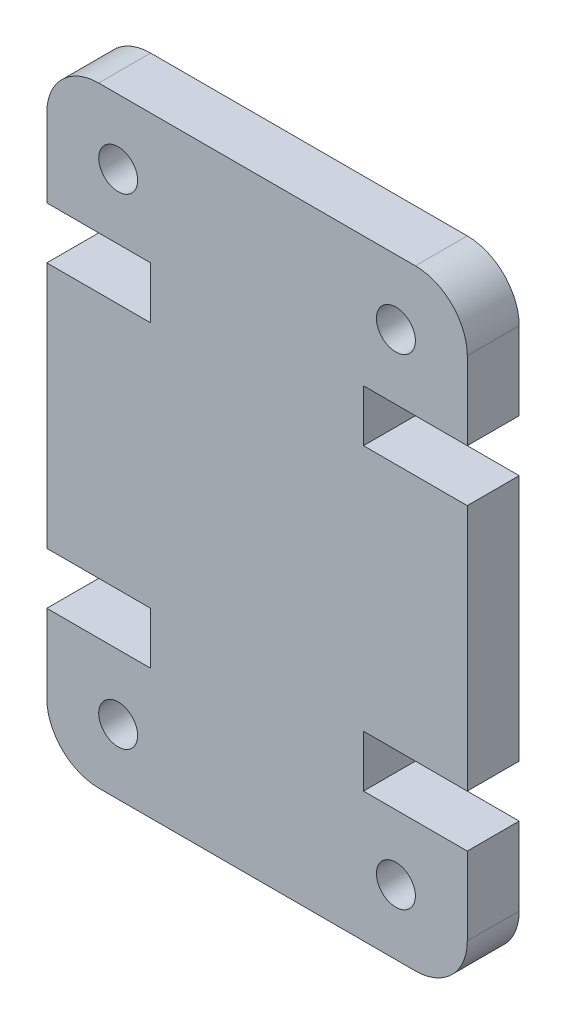
ISO-10303-21;
HEADER;
FILE_DESCRIPTION(('STEP AP214'),'2;1');
FILE_NAME('part.step','',(''),(''),'','','');
FILE_SCHEMA(('AUTOMOTIVE_DESIGN { 1 0 10303 214 1 1 1 1 }'));
ENDSEC;
DATA;
#1=APPLICATION_CONTEXT('core data for automotive mechanical design processes');
#2=APPLICATION_PROTOCOL_DEFINITION('international standard','automotive_design',2000,#1);
#3=PRODUCT_CONTEXT('',#1,'mechanical');
#4=PRODUCT('Part','Part','',(#3));
#5=PRODUCT_RELATED_PRODUCT_CATEGORY('part','',(#4));
#6=PRODUCT_DEFINITION_FORMATION('','',#4);
#7=PRODUCT_DEFINITION_CONTEXT('part definition',#1,'design');
#8=PRODUCT_DEFINITION('design','',#6,#7);
#9=PRODUCT_DEFINITION_SHAPE('','',#8);
#10=(LENGTH_UNIT() NAMED_UNIT(*) SI_UNIT(.MILLI.,.METRE.));
#11=(NAMED_UNIT(*) PLANE_ANGLE_UNIT() SI_UNIT($,.RADIAN.));
#12=(NAMED_UNIT(*) SI_UNIT($,.STERADIAN.) SOLID_ANGLE_UNIT());
#13=UNCERTAINTY_MEASURE_WITH_UNIT(LENGTH_MEASURE(1.E-05),#10,'distance_accuracy_value','');
#14=(GEOMETRIC_REPRESENTATION_CONTEXT(3) GLOBAL_UNCERTAINTY_ASSIGNED_CONTEXT((#13)) GLOBAL_UNIT_ASSIGNED_CONTEXT((#10,
#11,#12)) REPRESENTATION_CONTEXT('',''));
#15=CARTESIAN_POINT('',(0.,0.,0.));
#16=DIRECTION('',(0.,0.,1.));
#17=DIRECTION('',(1.,0.,0.));
#18=AXIS2_PLACEMENT_3D('',#15,#16,#17);
#19=CARTESIAN_POINT('',(14.2,2.,2.));
#20=DIRECTION('',(0.,0.,-1.));
#21=DIRECTION('',(-1.,0.,0.));
#22=AXIS2_PLACEMENT_3D('',#19,#20,#21);
#23=PLANE('',#22);
#24=CARTESIAN_POINT('',(13.4499999999986,21.0250000000001,2.));
#25=DIRECTION('',(0.,0.,1.));
#26=DIRECTION('',(1.,0.,0.));
#27=AXIS2_PLACEMENT_3D('',#24,#25,#26);
#28=CIRCLE('',#27,0.750000000000007);
#29=CARTESIAN_POINT('',(14.1999999999986,21.0250000000001,2.));
#30=VERTEX_POINT('',#29);
#31=EDGE_CURVE('E448',#30,#30,#28,.T.);
#32=ORIENTED_EDGE('',*,*,#31,.F.);
#33=EDGE_LOOP('',(#32));
#34=FACE_BOUND('',#33,.T.);
#35=CARTESIAN_POINT('',(13.4499999999986,2.4999999999999,2.));
#36=DIRECTION('',(0.,0.,1.));
#37=DIRECTION('',(-1.,0.,0.));
#38=AXIS2_PLACEMENT_3D('',#35,#36,#37);
#39=CIRCLE('',#38,0.750000000000008);
#40=CARTESIAN_POINT('',(12.6999999999986,2.4999999999999,2.));
#41=VERTEX_POINT('',#40);
#42=EDGE_CURVE('E230',#41,#41,#39,.T.);
#43=ORIENTED_EDGE('',*,*,#42,.F.);
#44=EDGE_LOOP('',(#43));
#45=FACE_BOUND('',#44,.T.);
#46=CARTESIAN_POINT('',(14.2,2.,2.));
#47=DIRECTION('',(0.,0.,1.));
#48=DIRECTION('',(-1.,0.,0.));
#49=AXIS2_PLACEMENT_3D('',#46,#47,#48);
#50=CIRCLE('',#49,2.);
#51=CARTESIAN_POINT('',(14.2,0.,2.));
#52=VERTEX_POINT('',#51);
#53=CARTESIAN_POINT('',(16.2,2.,2.));
#54=VERTEX_POINT('',#53);
#55=EDGE_CURVE('E273',#52,#54,#50,.T.);
#56=ORIENTED_EDGE('',*,*,#55,.T.);
#57=DIRECTION('',(0.,1.,0.));
#58=VECTOR('',#57,1.);
#59=CARTESIAN_POINT('',(16.2,5.00000000000014,2.));
#60=LINE('',#59,#58);
#61=CARTESIAN_POINT('',(16.2,5.00000000000014,2.));
#62=VERTEX_POINT('',#61);
#63=EDGE_CURVE('E141',#54,#62,#60,.T.);
#64=ORIENTED_EDGE('',*,*,#63,.T.);
#65=DIRECTION('',(-1.,0.,0.));
#66=VECTOR('',#65,1.);
#67=CARTESIAN_POINT('',(12.2,5.00000000000014,2.));
#68=LINE('',#67,#66);
#69=CARTESIAN_POINT('',(12.2,5.00000000000014,2.));
#70=VERTEX_POINT('',#69);
#71=EDGE_CURVE('E336',#62,#70,#68,.T.);
#72=ORIENTED_EDGE('',*,*,#71,.T.);
#73=DIRECTION('',(0.,1.,0.));
#74=VECTOR('',#73,1.);
#75=CARTESIAN_POINT('',(12.2,7.00000000000014,2.));
#76=LINE('',#75,#74);
#77=CARTESIAN_POINT('',(12.2,7.00000000000014,2.));
#78=VERTEX_POINT('',#77);
#79=EDGE_CURVE('E355',#70,#78,#76,.T.);
#80=ORIENTED_EDGE('',*,*,#79,.T.);
#81=DIRECTION('',(1.,0.,0.));
#82=VECTOR('',#81,1.);
#83=CARTESIAN_POINT('',(16.2,7.00000000000014,2.));
#84=LINE('',#83,#82);
#85=CARTESIAN_POINT('',(16.2,7.00000000000014,2.));
#86=VERTEX_POINT('',#85);
#87=EDGE_CURVE('E352',#78,#86,#84,.T.);
#88=ORIENTED_EDGE('',*,*,#87,.T.);
#89=DIRECTION('',(0.,1.,0.));
#90=VECTOR('',#89,1.);
#91=CARTESIAN_POINT('',(16.2,7.00000000000014,2.));
#92=LINE('',#91,#90);
#93=CARTESIAN_POINT('',(16.2,16.5249999999999,2.));
#94=VERTEX_POINT('',#93);
#95=EDGE_CURVE('E354',#86,#94,#92,.T.);
#96=ORIENTED_EDGE('',*,*,#95,.T.);
#97=DIRECTION('',(-1.,0.,0.));
#98=VECTOR('',#97,1.);
#99=CARTESIAN_POINT('',(16.2,16.5249999999999,2.));
#100=LINE('',#99,#98);
#101=CARTESIAN_POINT('',(12.2,16.5249999999999,2.));
#102=VERTEX_POINT('',#101);
#103=EDGE_CURVE('E357',#94,#102,#100,.T.);
#104=ORIENTED_EDGE('',*,*,#103,.T.);
#105=DIRECTION('',(0.,1.,0.));
#106=VECTOR('',#105,1.);
#107=CARTESIAN_POINT('',(12.2,16.5249999999999,2.));
#108=LINE('',#107,#106);
#109=CARTESIAN_POINT('',(12.2,18.5249999999999,2.));
#110=VERTEX_POINT('',#109);
#111=EDGE_CURVE('E363',#102,#110,#108,.T.);
#112=ORIENTED_EDGE('',*,*,#111,.T.);
#113=DIRECTION('',(1.,0.,0.));
#114=VECTOR('',#113,1.);
#115=CARTESIAN_POINT('',(12.2,18.5249999999999,2.));
#116=LINE('',#115,#114);
#117=CARTESIAN_POINT('',(16.2,18.5249999999999,2.));
#118=VERTEX_POINT('',#117);
#119=EDGE_CURVE('E365',#110,#118,#116,.T.);
#120=ORIENTED_EDGE('',*,*,#119,.T.);
#121=DIRECTION('',(0.,1.,0.));
#122=VECTOR('',#121,1.);
#123=CARTESIAN_POINT('',(16.2,18.5249999999999,2.));
#124=LINE('',#123,#122);
#125=CARTESIAN_POINT('',(16.2,21.525,2.));
#126=VERTEX_POINT('',#125);
#127=EDGE_CURVE('E367',#118,#126,#124,.T.);
#128=ORIENTED_EDGE('',*,*,#127,.T.);
#129=CARTESIAN_POINT('',(14.2,21.525,2.));
#130=DIRECTION('',(0.,0.,1.));
#131=DIRECTION('',(1.,0.,0.));
#132=AXIS2_PLACEMENT_3D('',#129,#130,#131);
#133=CIRCLE('',#132,2.);
#134=CARTESIAN_POINT('',(14.2,23.525,2.));
#135=VERTEX_POINT('',#134);
#136=EDGE_CURVE('E369',#126,#135,#133,.T.);
#137=ORIENTED_EDGE('',*,*,#136,.T.);
#138=DIRECTION('',(-1.,0.,0.));
#139=VECTOR('',#138,1.);
#140=CARTESIAN_POINT('',(1.99999999999999,23.525,2.));
#141=LINE('',#140,#139);
#142=CARTESIAN_POINT('',(1.99999999999999,23.525,2.));
#143=VERTEX_POINT('',#142);
#144=EDGE_CURVE('E371',#135,#143,#141,.T.);
#145=ORIENTED_EDGE('',*,*,#144,.T.);
#146=CARTESIAN_POINT('',(2.,21.525,2.));
#147=DIRECTION('',(0.,0.,1.));
#148=DIRECTION('',(-1.,0.,0.));
#149=AXIS2_PLACEMENT_3D('',#146,#147,#148);
#150=CIRCLE('',#149,2.);
#151=CARTESIAN_POINT('',(0.,21.525,2.));
#152=VERTEX_POINT('',#151);
#153=EDGE_CURVE('E373',#143,#152,#150,.T.);
#154=ORIENTED_EDGE('',*,*,#153,.T.);
#155=DIRECTION('',(0.,-1.,0.));
#156=VECTOR('',#155,1.);
#157=CARTESIAN_POINT('',(0.,18.5249999999999,2.));
#158=LINE('',#157,#156);
#159=CARTESIAN_POINT('',(0.,18.5249999999999,2.));
#160=VERTEX_POINT('',#159);
#161=EDGE_CURVE('E375',#152,#160,#158,.T.);
#162=ORIENTED_EDGE('',*,*,#161,.T.);
#163=DIRECTION('',(1.,0.,0.));
#164=VECTOR('',#163,1.);
#165=CARTESIAN_POINT('',(4.,18.5249999999999,2.));
#166=LINE('',#165,#164);
#167=CARTESIAN_POINT('',(4.,18.5249999999999,2.));
#168=VERTEX_POINT('',#167);
#169=EDGE_CURVE('E377',#160,#168,#166,.T.);
#170=ORIENTED_EDGE('',*,*,#169,.T.);
#171=DIRECTION('',(0.,-1.,0.));
#172=VECTOR('',#171,1.);
#173=CARTESIAN_POINT('',(4.,16.5249999999999,2.));
#174=LINE('',#173,#172);
#175=CARTESIAN_POINT('',(4.,16.5249999999999,2.));
#176=VERTEX_POINT('',#175);
#177=EDGE_CURVE('E379',#168,#176,#174,.T.);
#178=ORIENTED_EDGE('',*,*,#177,.T.);
#179=DIRECTION('',(-1.,0.,0.));
#180=VECTOR('',#179,1.);
#181=CARTESIAN_POINT('',(0.,16.5249999999999,2.));
#182=LINE('',#181,#180);
#183=CARTESIAN_POINT('',(0.,16.5249999999999,2.));
#184=VERTEX_POINT('',#183);
#185=EDGE_CURVE('E381',#176,#184,#182,.T.);
#186=ORIENTED_EDGE('',*,*,#185,.T.);
#187=DIRECTION('',(0.,-1.,0.));
#188=VECTOR('',#187,1.);
#189=CARTESIAN_POINT('',(0.,7.00000000000012,2.));
#190=LINE('',#189,#188);
#191=CARTESIAN_POINT('',(0.,7.00000000000012,2.));
#192=VERTEX_POINT('',#191);
#193=EDGE_CURVE('E383',#184,#192,#190,.T.);
#194=ORIENTED_EDGE('',*,*,#193,.T.);
#195=DIRECTION('',(1.,0.,0.));
#196=VECTOR('',#195,1.);
#197=CARTESIAN_POINT('',(0.,7.00000000000012,2.));
#198=LINE('',#197,#196);
#199=CARTESIAN_POINT('',(4.,7.00000000000014,2.));
#200=VERTEX_POINT('',#199);
#201=EDGE_CURVE('E385',#192,#200,#198,.T.);
#202=ORIENTED_EDGE('',*,*,#201,.T.);
#203=DIRECTION('',(0.,-1.,0.));
#204=VECTOR('',#203,1.);
#205=CARTESIAN_POINT('',(4.,7.00000000000014,2.));
#206=LINE('',#205,#204);
#207=CARTESIAN_POINT('',(4.,5.00000000000014,2.));
#208=VERTEX_POINT('',#207);
#209=EDGE_CURVE('E387',#200,#208,#206,.T.);
#210=ORIENTED_EDGE('',*,*,#209,.T.);
#211=DIRECTION('',(-1.,0.,0.));
#212=VECTOR('',#211,1.);
#213=CARTESIAN_POINT('',(4.,5.00000000000014,2.));
#214=LINE('',#213,#212);
#215=CARTESIAN_POINT('',(0.,5.00000000000014,2.));
#216=VERTEX_POINT('',#215);
#217=EDGE_CURVE('E208',#208,#216,#214,.T.);
#218=ORIENTED_EDGE('',*,*,#217,.T.);
#219=DIRECTION('',(0.,-1.,0.));
#220=VECTOR('',#219,1.);
#221=CARTESIAN_POINT('',(0.,5.00000000000014,2.));
#222=LINE('',#221,#220);
#223=CARTESIAN_POINT('',(0.,2.00000000000002,2.));
#224=VERTEX_POINT('',#223);
#225=EDGE_CURVE('E202',#216,#224,#222,.T.);
#226=ORIENTED_EDGE('',*,*,#225,.T.);
#227=CARTESIAN_POINT('',(2.,2.,2.));
#228=DIRECTION('',(0.,0.,1.));
#229=DIRECTION('',(1.,0.,0.));
#230=AXIS2_PLACEMENT_3D('',#227,#228,#229);
#231=CIRCLE('',#230,2.);
#232=CARTESIAN_POINT('',(2.,0.,2.));
#233=VERTEX_POINT('',#232);
#234=EDGE_CURVE('E206',#224,#233,#231,.T.);
#235=ORIENTED_EDGE('',*,*,#234,.T.);
#236=DIRECTION('',(1.,0.,0.));
#237=VECTOR('',#236,1.);
#238=CARTESIAN_POINT('',(2.,0.,2.));
#239=LINE('',#238,#237);
#240=EDGE_CURVE('E50',#233,#52,#239,.T.);
#241=ORIENTED_EDGE('',*,*,#240,.T.);
#242=EDGE_LOOP('',(#56,#64,#72,#80,#88,#96,#104,#112,#120,#128,#137,#145,#154,#162,#170,#178,
#186,#194,#202,#210,#218,#226,#235,#241));
#243=FACE_BOUND('',#242,.T.);
#244=CARTESIAN_POINT('',(2.75000000000137,21.0250000000001,2.));
#245=DIRECTION('',(0.,0.,1.));
#246=DIRECTION('',(-1.,0.,0.));
#247=AXIS2_PLACEMENT_3D('',#244,#245,#246);
#248=CIRCLE('',#247,0.749999999999999);
#249=CARTESIAN_POINT('',(2.00000000000137,21.0250000000001,2.));
#250=VERTEX_POINT('',#249);
#251=EDGE_CURVE('E454',#250,#250,#248,.T.);
#252=ORIENTED_EDGE('',*,*,#251,.F.);
#253=EDGE_LOOP('',(#252));
#254=FACE_BOUND('',#253,.T.);
#255=CARTESIAN_POINT('',(2.75000000000138,2.4999999999999,2.));
#256=DIRECTION('',(0.,0.,1.));
#257=DIRECTION('',(1.,0.,0.));
#258=AXIS2_PLACEMENT_3D('',#255,#256,#257);
#259=CIRCLE('',#258,0.75);
#260=CARTESIAN_POINT('',(3.50000000000138,2.4999999999999,2.));
#261=VERTEX_POINT('',#260);
#262=EDGE_CURVE('E439',#261,#261,#259,.T.);
#263=ORIENTED_EDGE('',*,*,#262,.F.);
#264=EDGE_LOOP('',(#263));
#265=FACE_BOUND('',#264,.T.);
#266=ADVANCED_FACE('F33',(#34,#45,#243,#254,#265),#23,.F.);
#267=CARTESIAN_POINT('',(14.2,2.,0.));
#268=DIRECTION('',(0.,0.,-1.));
#269=DIRECTION('',(-1.,0.,0.));
#270=AXIS2_PLACEMENT_3D('',#267,#268,#269);
#271=PLANE('',#270);
#272=CARTESIAN_POINT('',(13.4499999999986,21.0250000000001,0.));
#273=DIRECTION('',(0.,0.,1.));
#274=DIRECTION('',(1.,0.,0.));
#275=AXIS2_PLACEMENT_3D('',#272,#273,#274);
#276=CIRCLE('',#275,0.750000000000007);
#277=CARTESIAN_POINT('',(14.1999999999986,21.0250000000001,0.));
#278=VERTEX_POINT('',#277);
#279=EDGE_CURVE('E445',#278,#278,#276,.T.);
#280=ORIENTED_EDGE('',*,*,#279,.T.);
#281=EDGE_LOOP('',(#280));
#282=FACE_BOUND('',#281,.T.);
#283=CARTESIAN_POINT('',(13.4499999999986,2.4999999999999,0.));
#284=DIRECTION('',(0.,0.,1.));
#285=DIRECTION('',(-1.,0.,0.));
#286=AXIS2_PLACEMENT_3D('',#283,#284,#285);
#287=CIRCLE('',#286,0.750000000000008);
#288=CARTESIAN_POINT('',(12.6999999999986,2.4999999999999,0.));
#289=VERTEX_POINT('',#288);
#290=EDGE_CURVE('E457',#289,#289,#287,.T.);
#291=ORIENTED_EDGE('',*,*,#290,.T.);
#292=EDGE_LOOP('',(#291));
#293=FACE_BOUND('',#292,.T.);
#294=CARTESIAN_POINT('',(14.2,2.,0.));
#295=DIRECTION('',(0.,0.,1.));
#296=DIRECTION('',(-1.,0.,0.));
#297=AXIS2_PLACEMENT_3D('',#294,#295,#296);
#298=CIRCLE('',#297,2.);
#299=CARTESIAN_POINT('',(14.2,0.,0.));
#300=VERTEX_POINT('',#299);
#301=CARTESIAN_POINT('',(16.2,2.,0.));
#302=VERTEX_POINT('',#301);
#303=EDGE_CURVE('E226',#300,#302,#298,.T.);
#304=ORIENTED_EDGE('',*,*,#303,.F.);
#305=DIRECTION('',(1.,0.,0.));
#306=VECTOR('',#305,1.);
#307=CARTESIAN_POINT('',(2.,0.,0.));
#308=LINE('',#307,#306);
#309=CARTESIAN_POINT('',(2.,0.,0.));
#310=VERTEX_POINT('',#309);
#311=EDGE_CURVE('E133',#310,#300,#308,.T.);
#312=ORIENTED_EDGE('',*,*,#311,.F.);
#313=CARTESIAN_POINT('',(2.,2.,0.));
#314=DIRECTION('',(0.,0.,1.));
#315=DIRECTION('',(1.,0.,0.));
#316=AXIS2_PLACEMENT_3D('',#313,#314,#315);
#317=CIRCLE('',#316,2.);
#318=CARTESIAN_POINT('',(0.,2.00000000000002,0.));
#319=VERTEX_POINT('',#318);
#320=EDGE_CURVE('E127',#319,#310,#317,.T.);
#321=ORIENTED_EDGE('',*,*,#320,.F.);
#322=DIRECTION('',(0.,-1.,0.));
#323=VECTOR('',#322,1.);
#324=CARTESIAN_POINT('',(0.,5.00000000000014,0.));
#325=LINE('',#324,#323);
#326=CARTESIAN_POINT('',(0.,5.00000000000014,0.));
#327=VERTEX_POINT('',#326);
#328=EDGE_CURVE('E216',#327,#319,#325,.T.);
#329=ORIENTED_EDGE('',*,*,#328,.F.);
#330=DIRECTION('',(-1.,0.,0.));
#331=VECTOR('',#330,1.);
#332=CARTESIAN_POINT('',(4.,5.00000000000014,0.));
#333=LINE('',#332,#331);
#334=CARTESIAN_POINT('',(4.,5.00000000000014,0.));
#335=VERTEX_POINT('',#334);
#336=EDGE_CURVE('E268',#335,#327,#333,.T.);
#337=ORIENTED_EDGE('',*,*,#336,.F.);
#338=DIRECTION('',(0.,-1.,0.));
#339=VECTOR('',#338,1.);
#340=CARTESIAN_POINT('',(4.,7.00000000000014,0.));
#341=LINE('',#340,#339);
#342=CARTESIAN_POINT('',(4.,7.00000000000014,0.));
#343=VERTEX_POINT('',#342);
#344=EDGE_CURVE('E266',#343,#335,#341,.T.);
#345=ORIENTED_EDGE('',*,*,#344,.F.);
#346=DIRECTION('',(1.,0.,0.));
#347=VECTOR('',#346,1.);
#348=CARTESIAN_POINT('',(0.,7.00000000000012,0.));
#349=LINE('',#348,#347);
#350=CARTESIAN_POINT('',(0.,7.00000000000012,0.));
#351=VERTEX_POINT('',#350);
#352=EDGE_CURVE('E264',#351,#343,#349,.T.);
#353=ORIENTED_EDGE('',*,*,#352,.F.);
#354=DIRECTION('',(0.,-1.,0.));
#355=VECTOR('',#354,1.);
#356=CARTESIAN_POINT('',(0.,7.00000000000012,0.));
#357=LINE('',#356,#355);
#358=CARTESIAN_POINT('',(0.,16.5249999999999,0.));
#359=VERTEX_POINT('',#358);
#360=EDGE_CURVE('E262',#359,#351,#357,.T.);
#361=ORIENTED_EDGE('',*,*,#360,.F.);
#362=DIRECTION('',(-1.,0.,0.));
#363=VECTOR('',#362,1.);
#364=CARTESIAN_POINT('',(0.,16.5249999999999,0.));
#365=LINE('',#364,#363);
#366=CARTESIAN_POINT('',(4.,16.5249999999999,0.));
#367=VERTEX_POINT('',#366);
#368=EDGE_CURVE('E260',#367,#359,#365,.T.);
#369=ORIENTED_EDGE('',*,*,#368,.F.);
#370=DIRECTION('',(0.,-1.,0.));
#371=VECTOR('',#370,1.);
#372=CARTESIAN_POINT('',(4.,16.5249999999999,0.));
#373=LINE('',#372,#371);
#374=CARTESIAN_POINT('',(4.,18.5249999999999,0.));
#375=VERTEX_POINT('',#374);
#376=EDGE_CURVE('E258',#375,#367,#373,.T.);
#377=ORIENTED_EDGE('',*,*,#376,.F.);
#378=DIRECTION('',(1.,0.,0.));
#379=VECTOR('',#378,1.);
#380=CARTESIAN_POINT('',(4.,18.5249999999999,0.));
#381=LINE('',#380,#379);
#382=CARTESIAN_POINT('',(0.,18.5249999999999,0.));
#383=VERTEX_POINT('',#382);
#384=EDGE_CURVE('E256',#383,#375,#381,.T.);
#385=ORIENTED_EDGE('',*,*,#384,.F.);
#386=DIRECTION('',(0.,-1.,0.));
#387=VECTOR('',#386,1.);
#388=CARTESIAN_POINT('',(0.,18.5249999999999,0.));
#389=LINE('',#388,#387);
#390=CARTESIAN_POINT('',(0.,21.525,0.));
#391=VERTEX_POINT('',#390);
#392=EDGE_CURVE('E254',#391,#383,#389,.T.);
#393=ORIENTED_EDGE('',*,*,#392,.F.);
#394=CARTESIAN_POINT('',(2.,21.525,0.));
#395=DIRECTION('',(0.,0.,1.));
#396=DIRECTION('',(-1.,0.,0.));
#397=AXIS2_PLACEMENT_3D('',#394,#395,#396);
#398=CIRCLE('',#397,2.);
#399=CARTESIAN_POINT('',(1.99999999999999,23.525,0.));
#400=VERTEX_POINT('',#399);
#401=EDGE_CURVE('E252',#400,#391,#398,.T.);
#402=ORIENTED_EDGE('',*,*,#401,.F.);
#403=DIRECTION('',(-1.,0.,0.));
#404=VECTOR('',#403,1.);
#405=CARTESIAN_POINT('',(1.99999999999999,23.525,0.));
#406=LINE('',#405,#404);
#407=CARTESIAN_POINT('',(14.2,23.525,0.));
#408=VERTEX_POINT('',#407);
#409=EDGE_CURVE('E250',#408,#400,#406,.T.);
#410=ORIENTED_EDGE('',*,*,#409,.F.);
#411=CARTESIAN_POINT('',(14.2,21.525,0.));
#412=DIRECTION('',(0.,0.,1.));
#413=DIRECTION('',(1.,0.,0.));
#414=AXIS2_PLACEMENT_3D('',#411,#412,#413);
#415=CIRCLE('',#414,2.);
#416=CARTESIAN_POINT('',(16.2,21.525,0.));
#417=VERTEX_POINT('',#416);
#418=EDGE_CURVE('E248',#417,#408,#415,.T.);
#419=ORIENTED_EDGE('',*,*,#418,.F.);
#420=DIRECTION('',(0.,1.,0.));
#421=VECTOR('',#420,1.);
#422=CARTESIAN_POINT('',(16.2,18.5249999999999,0.));
#423=LINE('',#422,#421);
#424=CARTESIAN_POINT('',(16.2,18.5249999999999,0.));
#425=VERTEX_POINT('',#424);
#426=EDGE_CURVE('E246',#425,#417,#423,.T.);
#427=ORIENTED_EDGE('',*,*,#426,.F.);
#428=DIRECTION('',(1.,0.,0.));
#429=VECTOR('',#428,1.);
#430=CARTESIAN_POINT('',(12.2,18.5249999999999,0.));
#431=LINE('',#430,#429);
#432=CARTESIAN_POINT('',(12.2,18.5249999999999,0.));
#433=VERTEX_POINT('',#432);
#434=EDGE_CURVE('E244',#433,#425,#431,.T.);
#435=ORIENTED_EDGE('',*,*,#434,.F.);
#436=DIRECTION('',(0.,1.,0.));
#437=VECTOR('',#436,1.);
#438=CARTESIAN_POINT('',(12.2,16.5249999999999,0.));
#439=LINE('',#438,#437);
#440=CARTESIAN_POINT('',(12.2,16.5249999999999,0.));
#441=VERTEX_POINT('',#440);
#442=EDGE_CURVE('E242',#441,#433,#439,.T.);
#443=ORIENTED_EDGE('',*,*,#442,.F.);
#444=DIRECTION('',(-1.,0.,0.));
#445=VECTOR('',#444,1.);
#446=CARTESIAN_POINT('',(16.2,16.5249999999999,0.));
#447=LINE('',#446,#445);
#448=CARTESIAN_POINT('',(16.2,16.5249999999999,0.));
#449=VERTEX_POINT('',#448);
#450=EDGE_CURVE('E240',#449,#441,#447,.T.);
#451=ORIENTED_EDGE('',*,*,#450,.F.);
#452=DIRECTION('',(0.,1.,0.));
#453=VECTOR('',#452,1.);
#454=CARTESIAN_POINT('',(16.2,7.00000000000014,0.));
#455=LINE('',#454,#453);
#456=CARTESIAN_POINT('',(16.2,7.00000000000014,0.));
#457=VERTEX_POINT('',#456);
#458=EDGE_CURVE('E238',#457,#449,#455,.T.);
#459=ORIENTED_EDGE('',*,*,#458,.F.);
#460=DIRECTION('',(1.,0.,0.));
#461=VECTOR('',#460,1.);
#462=CARTESIAN_POINT('',(16.2,7.00000000000014,0.));
#463=LINE('',#462,#461);
#464=CARTESIAN_POINT('',(12.2,7.00000000000014,0.));
#465=VERTEX_POINT('',#464);
#466=EDGE_CURVE('E236',#465,#457,#463,.T.);
#467=ORIENTED_EDGE('',*,*,#466,.F.);
#468=DIRECTION('',(0.,1.,0.));
#469=VECTOR('',#468,1.);
#470=CARTESIAN_POINT('',(12.2,7.00000000000014,0.));
#471=LINE('',#470,#469);
#472=CARTESIAN_POINT('',(12.2,5.00000000000014,0.));
#473=VERTEX_POINT('',#472);
#474=EDGE_CURVE('E234',#473,#465,#471,.T.);
#475=ORIENTED_EDGE('',*,*,#474,.F.);
#476=DIRECTION('',(-1.,0.,0.));
#477=VECTOR('',#476,1.);
#478=CARTESIAN_POINT('',(12.2,5.00000000000014,0.));
#479=LINE('',#478,#477);
#480=CARTESIAN_POINT('',(16.2,5.00000000000014,0.));
#481=VERTEX_POINT('',#480);
#482=EDGE_CURVE('E232',#481,#473,#479,.T.);
#483=ORIENTED_EDGE('',*,*,#482,.F.);
#484=DIRECTION('',(0.,1.,0.));
#485=VECTOR('',#484,1.);
#486=CARTESIAN_POINT('',(16.2,5.00000000000014,0.));
#487=LINE('',#486,#485);
#488=EDGE_CURVE('E229',#302,#481,#487,.T.);
#489=ORIENTED_EDGE('',*,*,#488,.F.);
#490=EDGE_LOOP('',(#304,#312,#321,#329,#337,#345,#353,#361,#369,#377,#385,#393,#402,#410,#419,
#427,#435,#443,#451,#459,#467,#475,#483,#489));
#491=FACE_BOUND('',#490,.T.);
#492=CARTESIAN_POINT('',(2.75000000000137,21.0250000000001,0.));
#493=DIRECTION('',(0.,0.,1.));
#494=DIRECTION('',(-1.,0.,0.));
#495=AXIS2_PLACEMENT_3D('',#492,#493,#494);
#496=CIRCLE('',#495,0.749999999999999);
#497=CARTESIAN_POINT('',(2.00000000000137,21.0250000000001,0.));
#498=VERTEX_POINT('',#497);
#499=EDGE_CURVE('E451',#498,#498,#496,.T.);
#500=ORIENTED_EDGE('',*,*,#499,.T.);
#501=EDGE_LOOP('',(#500));
#502=FACE_BOUND('',#501,.T.);
#503=CARTESIAN_POINT('',(2.75000000000138,2.4999999999999,0.));
#504=DIRECTION('',(0.,0.,1.));
#505=DIRECTION('',(1.,0.,0.));
#506=AXIS2_PLACEMENT_3D('',#503,#504,#505);
#507=CIRCLE('',#506,0.75);
#508=CARTESIAN_POINT('',(3.50000000000138,2.4999999999999,0.));
#509=VERTEX_POINT('',#508);
#510=EDGE_CURVE('E442',#509,#509,#507,.T.);
#511=ORIENTED_EDGE('',*,*,#510,.T.);
#512=EDGE_LOOP('',(#511));
#513=FACE_BOUND('',#512,.T.);
#514=ADVANCED_FACE('F340',(#282,#293,#491,#502,#513),#271,.T.);
#515=CARTESIAN_POINT('',(14.2,2.,2.));
#516=DIRECTION('',(0.,0.,-1.));
#517=DIRECTION('',(-1.,0.,0.));
#518=AXIS2_PLACEMENT_3D('',#515,#516,#517);
#519=CYLINDRICAL_SURFACE('',#518,2.);
#520=ORIENTED_EDGE('',*,*,#303,.T.);
#521=DIRECTION('',(0.,0.,-1.));
#522=VECTOR('',#521,1.);
#523=CARTESIAN_POINT('',(16.2,2.,2.));
#524=LINE('',#523,#522);
#525=EDGE_CURVE('E11',#54,#302,#524,.T.);
#526=ORIENTED_EDGE('',*,*,#525,.F.);
#527=ORIENTED_EDGE('',*,*,#55,.F.);
#528=DIRECTION('',(0.,0.,-1.));
#529=VECTOR('',#528,1.);
#530=CARTESIAN_POINT('',(14.2,0.,2.));
#531=LINE('',#530,#529);
#532=EDGE_CURVE('E222',#52,#300,#531,.T.);
#533=ORIENTED_EDGE('',*,*,#532,.T.);
#534=EDGE_LOOP('',(#520,#526,#527,#533));
#535=FACE_BOUND('',#534,.T.);
#536=ADVANCED_FACE('F35',(#535),#519,.T.);
#537=CARTESIAN_POINT('',(16.2,5.00000000000014,2.));
#538=DIRECTION('',(-1.,0.,0.));
#539=DIRECTION('',(0.,-1.,0.));
#540=AXIS2_PLACEMENT_3D('',#537,#538,#539);
#541=PLANE('',#540);
#542=ORIENTED_EDGE('',*,*,#488,.T.);
#543=DIRECTION('',(0.,0.,-1.));
#544=VECTOR('',#543,1.);
#545=CARTESIAN_POINT('',(16.2,5.00000000000014,2.));
#546=LINE('',#545,#544);
#547=EDGE_CURVE('E42',#62,#481,#546,.T.);
#548=ORIENTED_EDGE('',*,*,#547,.F.);
#549=ORIENTED_EDGE('',*,*,#63,.F.);
#550=ORIENTED_EDGE('',*,*,#525,.T.);
#551=EDGE_LOOP('',(#542,#548,#549,#550));
#552=FACE_BOUND('',#551,.T.);
#553=ADVANCED_FACE('F686',(#552),#541,.F.);
#554=CARTESIAN_POINT('',(12.2,5.00000000000014,2.));
#555=DIRECTION('',(0.,-1.,0.));
#556=DIRECTION('',(0.,0.,-1.));
#557=AXIS2_PLACEMENT_3D('',#554,#555,#556);
#558=PLANE('',#557);
#559=ORIENTED_EDGE('',*,*,#482,.T.);
#560=DIRECTION('',(0.,0.,-1.));
#561=VECTOR('',#560,1.);
#562=CARTESIAN_POINT('',(12.2,5.00000000000014,2.));
#563=LINE('',#562,#561);
#564=EDGE_CURVE('E328',#70,#473,#563,.T.);
#565=ORIENTED_EDGE('',*,*,#564,.F.);
#566=ORIENTED_EDGE('',*,*,#71,.F.);
#567=ORIENTED_EDGE('',*,*,#547,.T.);
#568=EDGE_LOOP('',(#559,#565,#566,#567));
#569=FACE_BOUND('',#568,.T.);
#570=ADVANCED_FACE('F334',(#569),#558,.F.);
#571=CARTESIAN_POINT('',(12.2,7.00000000000014,2.));
#572=DIRECTION('',(-1.,0.,0.));
#573=DIRECTION('',(0.,0.,1.));
#574=AXIS2_PLACEMENT_3D('',#571,#572,#573);
#575=PLANE('',#574);
#576=ORIENTED_EDGE('',*,*,#474,.T.);
#577=DIRECTION('',(0.,0.,-1.));
#578=VECTOR('',#577,1.);
#579=CARTESIAN_POINT('',(12.2,7.00000000000014,2.));
#580=LINE('',#579,#578);
#581=EDGE_CURVE('E325',#78,#465,#580,.T.);
#582=ORIENTED_EDGE('',*,*,#581,.F.);
#583=ORIENTED_EDGE('',*,*,#79,.F.);
#584=ORIENTED_EDGE('',*,*,#564,.T.);
#585=EDGE_LOOP('',(#576,#582,#583,#584));
#586=FACE_BOUND('',#585,.T.);
#587=ADVANCED_FACE('F346',(#586),#575,.F.);
#588=CARTESIAN_POINT('',(16.2,7.00000000000014,2.));
#589=DIRECTION('',(0.,1.,0.));
#590=DIRECTION('',(-1.,0.,0.));
#591=AXIS2_PLACEMENT_3D('',#588,#589,#590);
#592=PLANE('',#591);
#593=ORIENTED_EDGE('',*,*,#466,.T.);
#594=DIRECTION('',(0.,0.,-1.));
#595=VECTOR('',#594,1.);
#596=CARTESIAN_POINT('',(16.2,7.00000000000014,2.));
#597=LINE('',#596,#595);
#598=EDGE_CURVE('E322',#86,#457,#597,.T.);
#599=ORIENTED_EDGE('',*,*,#598,.F.);
#600=ORIENTED_EDGE('',*,*,#87,.F.);
#601=ORIENTED_EDGE('',*,*,#581,.T.);
#602=EDGE_LOOP('',(#593,#599,#600,#601));
#603=FACE_BOUND('',#602,.T.);
#604=ADVANCED_FACE('F350',(#603),#592,.F.);
#605=CARTESIAN_POINT('',(16.2,7.00000000000014,2.));
#606=DIRECTION('',(-1.,0.,0.));
#607=DIRECTION('',(0.,0.,1.));
#608=AXIS2_PLACEMENT_3D('',#605,#606,#607);
#609=PLANE('',#608);
#610=ORIENTED_EDGE('',*,*,#458,.T.);
#611=DIRECTION('',(0.,0.,-1.));
#612=VECTOR('',#611,1.);
#613=CARTESIAN_POINT('',(16.2,16.5249999999999,2.));
#614=LINE('',#613,#612);
#615=EDGE_CURVE('E319',#94,#449,#614,.T.);
#616=ORIENTED_EDGE('',*,*,#615,.F.);
#617=ORIENTED_EDGE('',*,*,#95,.F.);
#618=ORIENTED_EDGE('',*,*,#598,.T.);
#619=EDGE_LOOP('',(#610,#616,#617,#618));
#620=FACE_BOUND('',#619,.T.);
#621=ADVANCED_FACE('F651',(#620),#609,.F.);
#622=CARTESIAN_POINT('',(16.2,16.5249999999999,2.));
#623=DIRECTION('',(0.,-1.,0.));
#624=DIRECTION('',(1.,0.,0.));
#625=AXIS2_PLACEMENT_3D('',#622,#623,#624);
#626=PLANE('',#625);
#627=ORIENTED_EDGE('',*,*,#450,.T.);
#628=DIRECTION('',(0.,0.,-1.));
#629=VECTOR('',#628,1.);
#630=CARTESIAN_POINT('',(12.2,16.5249999999999,2.));
#631=LINE('',#630,#629);
#632=EDGE_CURVE('E316',#102,#441,#631,.T.);
#633=ORIENTED_EDGE('',*,*,#632,.F.);
#634=ORIENTED_EDGE('',*,*,#103,.F.);
#635=ORIENTED_EDGE('',*,*,#615,.T.);
#636=EDGE_LOOP('',(#627,#633,#634,#635));
#637=FACE_BOUND('',#636,.T.);
#638=ADVANCED_FACE('F641',(#637),#626,.F.);
#639=CARTESIAN_POINT('',(12.2,16.5249999999999,2.));
#640=DIRECTION('',(-1.,0.,0.));
#641=DIRECTION('',(0.,0.,1.));
#642=AXIS2_PLACEMENT_3D('',#639,#640,#641);
#643=PLANE('',#642);
#644=ORIENTED_EDGE('',*,*,#442,.T.);
#645=DIRECTION('',(0.,0.,-1.));
#646=VECTOR('',#645,1.);
#647=CARTESIAN_POINT('',(12.2,18.5249999999999,2.));
#648=LINE('',#647,#646);
#649=EDGE_CURVE('E313',#110,#433,#648,.T.);
#650=ORIENTED_EDGE('',*,*,#649,.F.);
#651=ORIENTED_EDGE('',*,*,#111,.F.);
#652=ORIENTED_EDGE('',*,*,#632,.T.);
#653=EDGE_LOOP('',(#644,#650,#651,#652));
#654=FACE_BOUND('',#653,.T.);
#655=ADVANCED_FACE('F631',(#654),#643,.F.);
#656=CARTESIAN_POINT('',(12.2,18.5249999999999,2.));
#657=DIRECTION('',(0.,1.,0.));
#658=DIRECTION('',(0.,0.,1.));
#659=AXIS2_PLACEMENT_3D('',#656,#657,#658);
#660=PLANE('',#659);
#661=ORIENTED_EDGE('',*,*,#434,.T.);
#662=DIRECTION('',(0.,0.,-1.));
#663=VECTOR('',#662,1.);
#664=CARTESIAN_POINT('',(16.2,18.5249999999999,2.));
#665=LINE('',#664,#663);
#666=EDGE_CURVE('E310',#118,#425,#665,.T.);
#667=ORIENTED_EDGE('',*,*,#666,.F.);
#668=ORIENTED_EDGE('',*,*,#119,.F.);
#669=ORIENTED_EDGE('',*,*,#649,.T.);
#670=EDGE_LOOP('',(#661,#667,#668,#669));
#671=FACE_BOUND('',#670,.T.);
#672=ADVANCED_FACE('F621',(#671),#660,.F.);
#673=CARTESIAN_POINT('',(16.2,18.5249999999999,2.));
#674=DIRECTION('',(-1.,0.,0.));
#675=DIRECTION('',(0.,-1.,0.));
#676=AXIS2_PLACEMENT_3D('',#673,#674,#675);
#677=PLANE('',#676);
#678=ORIENTED_EDGE('',*,*,#426,.T.);
#679=DIRECTION('',(0.,0.,-1.));
#680=VECTOR('',#679,1.);
#681=CARTESIAN_POINT('',(16.2,21.525,2.));
#682=LINE('',#681,#680);
#683=EDGE_CURVE('E307',#126,#417,#682,.T.);
#684=ORIENTED_EDGE('',*,*,#683,.F.);
#685=ORIENTED_EDGE('',*,*,#127,.F.);
#686=ORIENTED_EDGE('',*,*,#666,.T.);
#687=EDGE_LOOP('',(#678,#684,#685,#686));
#688=FACE_BOUND('',#687,.T.);
#689=ADVANCED_FACE('F611',(#688),#677,.F.);
#690=CARTESIAN_POINT('',(14.2,21.525,2.));
#691=DIRECTION('',(0.,0.,-1.));
#692=DIRECTION('',(-1.,0.,0.));
#693=AXIS2_PLACEMENT_3D('',#690,#691,#692);
#694=CYLINDRICAL_SURFACE('',#693,2.);
#695=ORIENTED_EDGE('',*,*,#418,.T.);
#696=DIRECTION('',(0.,0.,-1.));
#697=VECTOR('',#696,1.);
#698=CARTESIAN_POINT('',(14.2,23.525,2.));
#699=LINE('',#698,#697);
#700=EDGE_CURVE('E304',#135,#408,#699,.T.);
#701=ORIENTED_EDGE('',*,*,#700,.F.);
#702=ORIENTED_EDGE('',*,*,#136,.F.);
#703=ORIENTED_EDGE('',*,*,#683,.T.);
#704=EDGE_LOOP('',(#695,#701,#702,#703));
#705=FACE_BOUND('',#704,.T.);
#706=ADVANCED_FACE('F601',(#705),#694,.T.);
#707=CARTESIAN_POINT('',(1.99999999999999,23.525,2.));
#708=DIRECTION('',(0.,-1.,0.));
#709=DIRECTION('',(0.,0.,-1.));
#710=AXIS2_PLACEMENT_3D('',#707,#708,#709);
#711=PLANE('',#710);
#712=ORIENTED_EDGE('',*,*,#409,.T.);
#713=DIRECTION('',(0.,0.,-1.));
#714=VECTOR('',#713,1.);
#715=CARTESIAN_POINT('',(1.99999999999999,23.525,2.));
#716=LINE('',#715,#714);
#717=EDGE_CURVE('E301',#143,#400,#716,.T.);
#718=ORIENTED_EDGE('',*,*,#717,.F.);
#719=ORIENTED_EDGE('',*,*,#144,.F.);
#720=ORIENTED_EDGE('',*,*,#700,.T.);
#721=EDGE_LOOP('',(#712,#718,#719,#720));
#722=FACE_BOUND('',#721,.T.);
#723=ADVANCED_FACE('F591',(#722),#711,.F.);
#724=CARTESIAN_POINT('',(2.,21.525,2.));
#725=DIRECTION('',(0.,0.,-1.));
#726=DIRECTION('',(-1.,0.,0.));
#727=AXIS2_PLACEMENT_3D('',#724,#725,#726);
#728=CYLINDRICAL_SURFACE('',#727,2.);
#729=ORIENTED_EDGE('',*,*,#401,.T.);
#730=DIRECTION('',(0.,0.,-1.));
#731=VECTOR('',#730,1.);
#732=CARTESIAN_POINT('',(0.,21.525,2.));
#733=LINE('',#732,#731);
#734=EDGE_CURVE('E298',#152,#391,#733,.T.);
#735=ORIENTED_EDGE('',*,*,#734,.F.);
#736=ORIENTED_EDGE('',*,*,#153,.F.);
#737=ORIENTED_EDGE('',*,*,#717,.T.);
#738=EDGE_LOOP('',(#729,#735,#736,#737));
#739=FACE_BOUND('',#738,.T.);
#740=ADVANCED_FACE('F581',(#739),#728,.T.);
#741=CARTESIAN_POINT('',(0.,18.5249999999999,2.));
#742=DIRECTION('',(1.,0.,0.));
#743=DIRECTION('',(0.,1.,0.));
#744=AXIS2_PLACEMENT_3D('',#741,#742,#743);
#745=PLANE('',#744);
#746=ORIENTED_EDGE('',*,*,#392,.T.);
#747=DIRECTION('',(0.,0.,-1.));
#748=VECTOR('',#747,1.);
#749=CARTESIAN_POINT('',(0.,18.5249999999999,2.));
#750=LINE('',#749,#748);
#751=EDGE_CURVE('E295',#160,#383,#750,.T.);
#752=ORIENTED_EDGE('',*,*,#751,.F.);
#753=ORIENTED_EDGE('',*,*,#161,.F.);
#754=ORIENTED_EDGE('',*,*,#734,.T.);
#755=EDGE_LOOP('',(#746,#752,#753,#754));
#756=FACE_BOUND('',#755,.T.);
#757=ADVANCED_FACE('F571',(#756),#745,.F.);
#758=CARTESIAN_POINT('',(4.,18.5249999999999,2.));
#759=DIRECTION('',(0.,1.,0.));
#760=DIRECTION('',(-1.,0.,0.));
#761=AXIS2_PLACEMENT_3D('',#758,#759,#760);
#762=PLANE('',#761);
#763=ORIENTED_EDGE('',*,*,#384,.T.);
#764=DIRECTION('',(0.,0.,-1.));
#765=VECTOR('',#764,1.);
#766=CARTESIAN_POINT('',(4.,18.5249999999999,2.));
#767=LINE('',#766,#765);
#768=EDGE_CURVE('E292',#168,#375,#767,.T.);
#769=ORIENTED_EDGE('',*,*,#768,.F.);
#770=ORIENTED_EDGE('',*,*,#169,.F.);
#771=ORIENTED_EDGE('',*,*,#751,.T.);
#772=EDGE_LOOP('',(#763,#769,#770,#771));
#773=FACE_BOUND('',#772,.T.);
#774=ADVANCED_FACE('F561',(#773),#762,.F.);
#775=CARTESIAN_POINT('',(4.,16.5249999999999,2.));
#776=DIRECTION('',(1.,0.,0.));
#777=DIRECTION('',(0.,0.,-1.));
#778=AXIS2_PLACEMENT_3D('',#775,#776,#777);
#779=PLANE('',#778);
#780=ORIENTED_EDGE('',*,*,#376,.T.);
#781=DIRECTION('',(0.,0.,-1.));
#782=VECTOR('',#781,1.);
#783=CARTESIAN_POINT('',(4.,16.5249999999999,2.));
#784=LINE('',#783,#782);
#785=EDGE_CURVE('E289',#176,#367,#784,.T.);
#786=ORIENTED_EDGE('',*,*,#785,.F.);
#787=ORIENTED_EDGE('',*,*,#177,.F.);
#788=ORIENTED_EDGE('',*,*,#768,.T.);
#789=EDGE_LOOP('',(#780,#786,#787,#788));
#790=FACE_BOUND('',#789,.T.);
#791=ADVANCED_FACE('F551',(#790),#779,.F.);
#792=CARTESIAN_POINT('',(0.,16.5249999999999,2.));
#793=DIRECTION('',(0.,-1.,0.));
#794=DIRECTION('',(1.,0.,0.));
#795=AXIS2_PLACEMENT_3D('',#792,#793,#794);
#796=PLANE('',#795);
#797=ORIENTED_EDGE('',*,*,#368,.T.);
#798=DIRECTION('',(0.,0.,-1.));
#799=VECTOR('',#798,1.);
#800=CARTESIAN_POINT('',(0.,16.5249999999999,2.));
#801=LINE('',#800,#799);
#802=EDGE_CURVE('E286',#184,#359,#801,.T.);
#803=ORIENTED_EDGE('',*,*,#802,.F.);
#804=ORIENTED_EDGE('',*,*,#185,.F.);
#805=ORIENTED_EDGE('',*,*,#785,.T.);
#806=EDGE_LOOP('',(#797,#803,#804,#805));
#807=FACE_BOUND('',#806,.T.);
#808=ADVANCED_FACE('F541',(#807),#796,.F.);
#809=CARTESIAN_POINT('',(0.,7.00000000000012,2.));
#810=DIRECTION('',(1.,0.,0.));
#811=DIRECTION('',(0.,0.,-1.));
#812=AXIS2_PLACEMENT_3D('',#809,#810,#811);
#813=PLANE('',#812);
#814=ORIENTED_EDGE('',*,*,#360,.T.);
#815=DIRECTION('',(0.,0.,-1.));
#816=VECTOR('',#815,1.);
#817=CARTESIAN_POINT('',(0.,7.00000000000012,2.));
#818=LINE('',#817,#816);
#819=EDGE_CURVE('E283',#192,#351,#818,.T.);
#820=ORIENTED_EDGE('',*,*,#819,.F.);
#821=ORIENTED_EDGE('',*,*,#193,.F.);
#822=ORIENTED_EDGE('',*,*,#802,.T.);
#823=EDGE_LOOP('',(#814,#820,#821,#822));
#824=FACE_BOUND('',#823,.T.);
#825=ADVANCED_FACE('F531',(#824),#813,.F.);
#826=CARTESIAN_POINT('',(0.,7.00000000000012,2.));
#827=DIRECTION('',(0.,1.,0.));
#828=DIRECTION('',(-1.,0.,0.));
#829=AXIS2_PLACEMENT_3D('',#826,#827,#828);
#830=PLANE('',#829);
#831=ORIENTED_EDGE('',*,*,#352,.T.);
#832=DIRECTION('',(0.,0.,-1.));
#833=VECTOR('',#832,1.);
#834=CARTESIAN_POINT('',(4.,7.00000000000014,2.));
#835=LINE('',#834,#833);
#836=EDGE_CURVE('E280',#200,#343,#835,.T.);
#837=ORIENTED_EDGE('',*,*,#836,.F.);
#838=ORIENTED_EDGE('',*,*,#201,.F.);
#839=ORIENTED_EDGE('',*,*,#819,.T.);
#840=EDGE_LOOP('',(#831,#837,#838,#839));
#841=FACE_BOUND('',#840,.T.);
#842=ADVANCED_FACE('F522',(#841),#830,.F.);
#843=CARTESIAN_POINT('',(4.,7.00000000000014,2.));
#844=DIRECTION('',(1.,0.,0.));
#845=DIRECTION('',(0.,0.,-1.));
#846=AXIS2_PLACEMENT_3D('',#843,#844,#845);
#847=PLANE('',#846);
#848=ORIENTED_EDGE('',*,*,#344,.T.);
#849=DIRECTION('',(0.,0.,-1.));
#850=VECTOR('',#849,1.);
#851=CARTESIAN_POINT('',(4.,5.00000000000014,2.));
#852=LINE('',#851,#850);
#853=EDGE_CURVE('E277',#208,#335,#852,.T.);
#854=ORIENTED_EDGE('',*,*,#853,.F.);
#855=ORIENTED_EDGE('',*,*,#209,.F.);
#856=ORIENTED_EDGE('',*,*,#836,.T.);
#857=EDGE_LOOP('',(#848,#854,#855,#856));
#858=FACE_BOUND('',#857,.T.);
#859=ADVANCED_FACE('F393',(#858),#847,.F.);
#860=CARTESIAN_POINT('',(4.,5.00000000000014,2.));
#861=DIRECTION('',(0.,-1.,0.));
#862=DIRECTION('',(1.,0.,0.));
#863=AXIS2_PLACEMENT_3D('',#860,#861,#862);
#864=PLANE('',#863);
#865=ORIENTED_EDGE('',*,*,#336,.T.);
#866=DIRECTION('',(0.,0.,-1.));
#867=VECTOR('',#866,1.);
#868=CARTESIAN_POINT('',(0.,5.00000000000014,2.));
#869=LINE('',#868,#867);
#870=EDGE_CURVE('E217',#216,#327,#869,.T.);
#871=ORIENTED_EDGE('',*,*,#870,.F.);
#872=ORIENTED_EDGE('',*,*,#217,.F.);
#873=ORIENTED_EDGE('',*,*,#853,.T.);
#874=EDGE_LOOP('',(#865,#871,#872,#873));
#875=FACE_BOUND('',#874,.T.);
#876=ADVANCED_FACE('F397',(#875),#864,.F.);
#877=CARTESIAN_POINT('',(0.,5.00000000000014,2.));
#878=DIRECTION('',(1.,0.,0.));
#879=DIRECTION('',(0.,0.,-1.));
#880=AXIS2_PLACEMENT_3D('',#877,#878,#879);
#881=PLANE('',#880);
#882=ORIENTED_EDGE('',*,*,#328,.T.);
#883=DIRECTION('',(0.,0.,-1.));
#884=VECTOR('',#883,1.);
#885=CARTESIAN_POINT('',(0.,2.00000000000002,2.));
#886=LINE('',#885,#884);
#887=EDGE_CURVE('E213',#224,#319,#886,.T.);
#888=ORIENTED_EDGE('',*,*,#887,.F.);
#889=ORIENTED_EDGE('',*,*,#225,.F.);
#890=ORIENTED_EDGE('',*,*,#870,.T.);
#891=EDGE_LOOP('',(#882,#888,#889,#890));
#892=FACE_BOUND('',#891,.T.);
#893=ADVANCED_FACE('F214',(#892),#881,.F.);
#894=CARTESIAN_POINT('',(2.,2.,2.));
#895=DIRECTION('',(0.,0.,-1.));
#896=DIRECTION('',(-1.,0.,0.));
#897=AXIS2_PLACEMENT_3D('',#894,#895,#896);
#898=CYLINDRICAL_SURFACE('',#897,2.);
#899=ORIENTED_EDGE('',*,*,#320,.T.);
#900=DIRECTION('',(0.,0.,-1.));
#901=VECTOR('',#900,1.);
#902=CARTESIAN_POINT('',(2.,0.,2.));
#903=LINE('',#902,#901);
#904=EDGE_CURVE('E218',#233,#310,#903,.T.);
#905=ORIENTED_EDGE('',*,*,#904,.F.);
#906=ORIENTED_EDGE('',*,*,#234,.F.);
#907=ORIENTED_EDGE('',*,*,#887,.T.);
#908=EDGE_LOOP('',(#899,#905,#906,#907));
#909=FACE_BOUND('',#908,.T.);
#910=ADVANCED_FACE('F220',(#909),#898,.T.);
#911=CARTESIAN_POINT('',(2.,0.,2.));
#912=DIRECTION('',(0.,1.,0.));
#913=DIRECTION('',(-1.,0.,0.));
#914=AXIS2_PLACEMENT_3D('',#911,#912,#913);
#915=PLANE('',#914);
#916=ORIENTED_EDGE('',*,*,#311,.T.);
#917=ORIENTED_EDGE('',*,*,#532,.F.);
#918=ORIENTED_EDGE('',*,*,#240,.F.);
#919=ORIENTED_EDGE('',*,*,#904,.T.);
#920=EDGE_LOOP('',(#916,#917,#918,#919));
#921=FACE_BOUND('',#920,.T.);
#922=ADVANCED_FACE('F401',(#921),#915,.F.);
#923=CARTESIAN_POINT('',(13.4499999999986,2.4999999999999,2.));
#924=DIRECTION('',(0.,0.,-1.));
#925=DIRECTION('',(-1.,0.,0.));
#926=AXIS2_PLACEMENT_3D('',#923,#924,#925);
#927=CYLINDRICAL_SURFACE('',#926,0.750000000000008);
#928=ORIENTED_EDGE('',*,*,#42,.T.);
#929=EDGE_LOOP('',(#928));
#930=FACE_BOUND('',#929,.T.);
#931=ORIENTED_EDGE('',*,*,#290,.F.);
#932=EDGE_LOOP('',(#931));
#933=FACE_BOUND('',#932,.T.);
#934=ADVANCED_FACE('F403',(#930,#933),#927,.F.);
#935=CARTESIAN_POINT('',(2.75000000000137,21.0250000000001,2.));
#936=DIRECTION('',(0.,0.,-1.));
#937=DIRECTION('',(-1.,0.,0.));
#938=AXIS2_PLACEMENT_3D('',#935,#936,#937);
#939=CYLINDRICAL_SURFACE('',#938,0.749999999999999);
#940=ORIENTED_EDGE('',*,*,#251,.T.);
#941=EDGE_LOOP('',(#940));
#942=FACE_BOUND('',#941,.T.);
#943=ORIENTED_EDGE('',*,*,#499,.F.);
#944=EDGE_LOOP('',(#943));
#945=FACE_BOUND('',#944,.T.);
#946=ADVANCED_FACE('F409',(#942,#945),#939,.F.);
#947=CARTESIAN_POINT('',(13.4499999999986,21.0250000000001,2.));
#948=DIRECTION('',(0.,0.,-1.));
#949=DIRECTION('',(-1.,0.,0.));
#950=AXIS2_PLACEMENT_3D('',#947,#948,#949);
#951=CYLINDRICAL_SURFACE('',#950,0.750000000000007);
#952=ORIENTED_EDGE('',*,*,#31,.T.);
#953=EDGE_LOOP('',(#952));
#954=FACE_BOUND('',#953,.T.);
#955=ORIENTED_EDGE('',*,*,#279,.F.);
#956=EDGE_LOOP('',(#955));
#957=FACE_BOUND('',#956,.T.);
#958=ADVANCED_FACE('F426',(#954,#957),#951,.F.);
#959=CARTESIAN_POINT('',(2.75000000000138,2.4999999999999,2.));
#960=DIRECTION('',(0.,0.,-1.));
#961=DIRECTION('',(-1.,0.,0.));
#962=AXIS2_PLACEMENT_3D('',#959,#960,#961);
#963=CYLINDRICAL_SURFACE('',#962,0.75);
#964=ORIENTED_EDGE('',*,*,#262,.T.);
#965=EDGE_LOOP('',(#964));
#966=FACE_BOUND('',#965,.T.);
#967=ORIENTED_EDGE('',*,*,#510,.F.);
#968=EDGE_LOOP('',(#967));
#969=FACE_BOUND('',#968,.T.);
#970=ADVANCED_FACE('F430',(#966,#969),#963,.F.);
#971=CLOSED_SHELL('',(#266,#514,#536,#553,#570,#587,#604,#621,#638,#655,#672,#689,#706,#723,
#740,#757,#774,#791,#808,#825,#842,#859,#876,#893,#910,#922,#934,#946,#958,#970));
#972=MANIFOLD_SOLID_BREP('B2',#971);
#973=ADVANCED_BREP_SHAPE_REPRESENTATION('',(#18,#972),#14);
#974=SHAPE_DEFINITION_REPRESENTATION(#9,#973);
ENDSEC;
END-ISO-10303-21;
